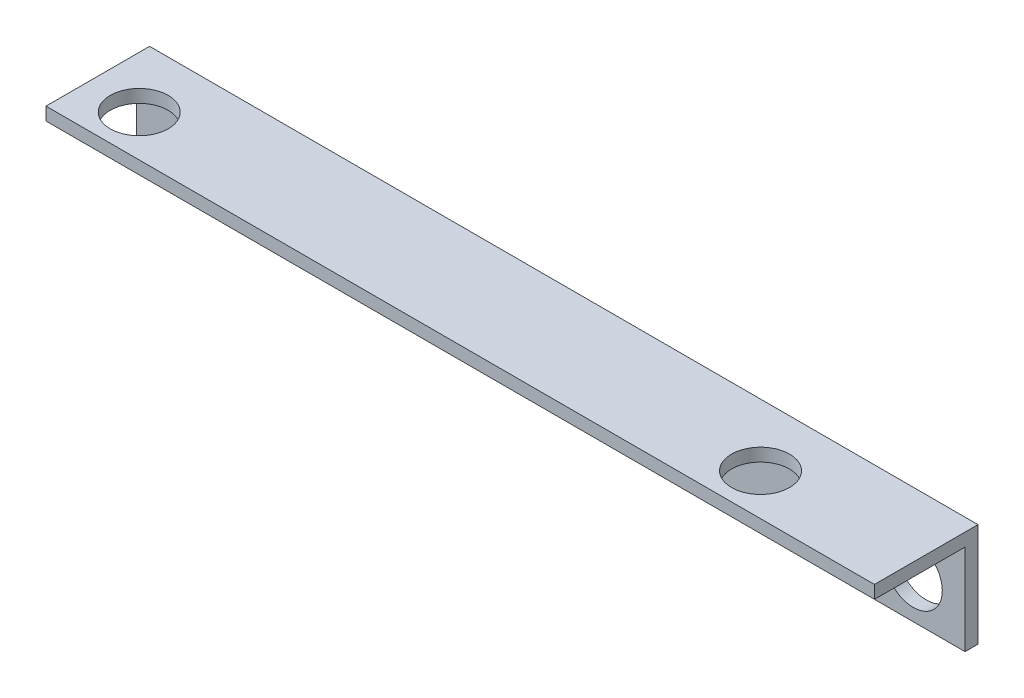
ISO-10303-21;
HEADER;
FILE_DESCRIPTION(('STEP AP214'),'2;1');
FILE_NAME('part.step','',(''),(''),'','','');
FILE_SCHEMA(('AUTOMOTIVE_DESIGN { 1 0 10303 214 1 1 1 1 }'));
ENDSEC;
DATA;
#1=APPLICATION_CONTEXT('core data for automotive mechanical design processes');
#2=APPLICATION_PROTOCOL_DEFINITION('international standard','automotive_design',2000,#1);
#3=PRODUCT_CONTEXT('',#1,'mechanical');
#4=PRODUCT('Part','Part','',(#3));
#5=PRODUCT_RELATED_PRODUCT_CATEGORY('part','',(#4));
#6=PRODUCT_DEFINITION_FORMATION('','',#4);
#7=PRODUCT_DEFINITION_CONTEXT('part definition',#1,'design');
#8=PRODUCT_DEFINITION('design','',#6,#7);
#9=PRODUCT_DEFINITION_SHAPE('','',#8);
#10=(LENGTH_UNIT() NAMED_UNIT(*) SI_UNIT(.MILLI.,.METRE.));
#11=(NAMED_UNIT(*) PLANE_ANGLE_UNIT() SI_UNIT($,.RADIAN.));
#12=(NAMED_UNIT(*) SI_UNIT($,.STERADIAN.) SOLID_ANGLE_UNIT());
#13=UNCERTAINTY_MEASURE_WITH_UNIT(LENGTH_MEASURE(1.E-05),#10,'distance_accuracy_value','');
#14=(GEOMETRIC_REPRESENTATION_CONTEXT(3) GLOBAL_UNCERTAINTY_ASSIGNED_CONTEXT((#13)) GLOBAL_UNIT_ASSIGNED_CONTEXT((#10,
#11,#12)) REPRESENTATION_CONTEXT('',''));
#15=CARTESIAN_POINT('',(0.,0.,0.));
#16=DIRECTION('',(0.,0.,1.));
#17=DIRECTION('',(1.,0.,0.));
#18=AXIS2_PLACEMENT_3D('',#15,#16,#17);
#19=CARTESIAN_POINT('',(-44.45,0.,1.5875));
#20=DIRECTION('',(0.,-1.,0.));
#21=DIRECTION('',(0.,0.,-1.));
#22=AXIS2_PLACEMENT_3D('',#19,#20,#21);
#23=PLANE('',#22);
#24=DIRECTION('',(1.,0.,0.));
#25=VECTOR('',#24,1.);
#26=CARTESIAN_POINT('',(-44.45,0.,0.));
#27=LINE('',#26,#25);
#28=CARTESIAN_POINT('',(-44.45,0.,0.));
#29=VERTEX_POINT('',#28);
#30=CARTESIAN_POINT('',(57.15,0.,0.));
#31=VERTEX_POINT('',#30);
#32=EDGE_CURVE('E45',#29,#31,#27,.T.);
#33=ORIENTED_EDGE('',*,*,#32,.T.);
#34=DIRECTION('',(0.,0.,-1.));
#35=VECTOR('',#34,1.);
#36=CARTESIAN_POINT('',(57.15,0.,1.5875));
#37=LINE('',#36,#35);
#38=CARTESIAN_POINT('',(57.15,0.,1.5875));
#39=VERTEX_POINT('',#38);
#40=EDGE_CURVE('E95',#39,#31,#37,.T.);
#41=ORIENTED_EDGE('',*,*,#40,.F.);
#42=DIRECTION('',(1.,0.,0.));
#43=VECTOR('',#42,1.);
#44=CARTESIAN_POINT('',(-44.45,0.,1.5875));
#45=LINE('',#44,#43);
#46=CARTESIAN_POINT('',(-44.45,0.,1.5875));
#47=VERTEX_POINT('',#46);
#48=EDGE_CURVE('E11',#47,#39,#45,.T.);
#49=ORIENTED_EDGE('',*,*,#48,.F.);
#50=DIRECTION('',(0.,0.,-1.));
#51=VECTOR('',#50,1.);
#52=CARTESIAN_POINT('',(-44.45,0.,1.5875));
#53=LINE('',#52,#51);
#54=EDGE_CURVE('E96',#47,#29,#53,.T.);
#55=ORIENTED_EDGE('',*,*,#54,.T.);
#56=EDGE_LOOP('',(#33,#41,#49,#55));
#57=FACE_BOUND('',#56,.T.);
#58=ADVANCED_FACE('F42',(#57),#23,.T.);
#59=CARTESIAN_POINT('',(-44.45,0.,1.5875));
#60=DIRECTION('',(0.,0.,1.));
#61=DIRECTION('',(1.,0.,0.));
#62=AXIS2_PLACEMENT_3D('',#59,#60,#61);
#63=PLANE('',#62);
#64=CARTESIAN_POINT('',(-25.4,5.08000000000001,1.5875));
#65=DIRECTION('',(0.,0.,1.));
#66=DIRECTION('',(1.,0.,0.));
#67=AXIS2_PLACEMENT_3D('',#64,#65,#66);
#68=CIRCLE('',#67,3.556);
#69=CARTESIAN_POINT('',(-21.844,5.08000000000001,1.5875));
#70=VERTEX_POINT('',#69);
#71=EDGE_CURVE('E117',#70,#70,#68,.T.);
#72=ORIENTED_EDGE('',*,*,#71,.F.);
#73=EDGE_LOOP('',(#72));
#74=FACE_BOUND('',#73,.T.);
#75=CARTESIAN_POINT('',(50.8,5.08,1.5875));
#76=DIRECTION('',(0.,0.,1.));
#77=DIRECTION('',(1.,0.,0.));
#78=AXIS2_PLACEMENT_3D('',#75,#76,#77);
#79=CIRCLE('',#78,3.556);
#80=CARTESIAN_POINT('',(54.356,5.08,1.5875));
#81=VERTEX_POINT('',#80);
#82=EDGE_CURVE('E121',#81,#81,#79,.T.);
#83=ORIENTED_EDGE('',*,*,#82,.F.);
#84=EDGE_LOOP('',(#83));
#85=FACE_BOUND('',#84,.T.);
#86=ORIENTED_EDGE('',*,*,#48,.T.);
#87=DIRECTION('',(0.,-1.,0.));
#88=VECTOR('',#87,1.);
#89=CARTESIAN_POINT('',(57.15,0.,1.5875));
#90=LINE('',#89,#88);
#91=CARTESIAN_POINT('',(57.15,11.1125,1.5875));
#92=VERTEX_POINT('',#91);
#93=EDGE_CURVE('E115',#92,#39,#90,.T.);
#94=ORIENTED_EDGE('',*,*,#93,.F.);
#95=DIRECTION('',(1.,0.,0.));
#96=VECTOR('',#95,1.);
#97=CARTESIAN_POINT('',(-44.45,11.1125,1.5875));
#98=LINE('',#97,#96);
#99=CARTESIAN_POINT('',(-44.45,11.1125,1.5875));
#100=VERTEX_POINT('',#99);
#101=EDGE_CURVE('E51',#100,#92,#98,.T.);
#102=ORIENTED_EDGE('',*,*,#101,.F.);
#103=DIRECTION('',(0.,-1.,0.));
#104=VECTOR('',#103,1.);
#105=CARTESIAN_POINT('',(-44.45,0.,1.5875));
#106=LINE('',#105,#104);
#107=EDGE_CURVE('E102',#100,#47,#106,.T.);
#108=ORIENTED_EDGE('',*,*,#107,.T.);
#109=EDGE_LOOP('',(#86,#94,#102,#108));
#110=FACE_BOUND('',#109,.T.);
#111=ADVANCED_FACE('F176',(#74,#85,#110),#63,.T.);
#112=CARTESIAN_POINT('',(-44.45,11.1125,1.5875));
#113=DIRECTION('',(0.,-1.,0.));
#114=DIRECTION('',(0.,0.,-1.));
#115=AXIS2_PLACEMENT_3D('',#112,#113,#114);
#116=PLANE('',#115);
#117=CARTESIAN_POINT('',(-38.1,11.1125,7.62));
#118=DIRECTION('',(0.,-1.,0.));
#119=DIRECTION('',(0.,0.,-1.));
#120=AXIS2_PLACEMENT_3D('',#117,#118,#119);
#121=CIRCLE('',#120,3.55600000000001);
#122=CARTESIAN_POINT('',(-38.1,11.1125,4.06399999999999));
#123=VERTEX_POINT('',#122);
#124=EDGE_CURVE('E211',#123,#123,#121,.T.);
#125=ORIENTED_EDGE('',*,*,#124,.F.);
#126=EDGE_LOOP('',(#125));
#127=FACE_BOUND('',#126,.T.);
#128=CARTESIAN_POINT('',(38.1,11.1125,7.62));
#129=DIRECTION('',(0.,-1.,0.));
#130=DIRECTION('',(0.,0.,-1.));
#131=AXIS2_PLACEMENT_3D('',#128,#129,#130);
#132=CIRCLE('',#131,3.55600000000001);
#133=CARTESIAN_POINT('',(38.1,11.1125,4.06399999999999));
#134=VERTEX_POINT('',#133);
#135=EDGE_CURVE('E217',#134,#134,#132,.T.);
#136=ORIENTED_EDGE('',*,*,#135,.F.);
#137=EDGE_LOOP('',(#136));
#138=FACE_BOUND('',#137,.T.);
#139=ORIENTED_EDGE('',*,*,#101,.T.);
#140=DIRECTION('',(0.,0.,-1.));
#141=VECTOR('',#140,1.);
#142=CARTESIAN_POINT('',(57.15,11.1125,1.5875));
#143=LINE('',#142,#141);
#144=CARTESIAN_POINT('',(57.15,11.1125,12.7));
#145=VERTEX_POINT('',#144);
#146=EDGE_CURVE('E131',#145,#92,#143,.T.);
#147=ORIENTED_EDGE('',*,*,#146,.F.);
#148=DIRECTION('',(1.,0.,0.));
#149=VECTOR('',#148,1.);
#150=CARTESIAN_POINT('',(-44.45,11.1125,12.7));
#151=LINE('',#150,#149);
#152=CARTESIAN_POINT('',(-44.45,11.1125,12.7));
#153=VERTEX_POINT('',#152);
#154=EDGE_CURVE('E156',#153,#145,#151,.T.);
#155=ORIENTED_EDGE('',*,*,#154,.F.);
#156=DIRECTION('',(0.,0.,-1.));
#157=VECTOR('',#156,1.);
#158=CARTESIAN_POINT('',(-44.45,11.1125,1.5875));
#159=LINE('',#158,#157);
#160=EDGE_CURVE('E149',#153,#100,#159,.T.);
#161=ORIENTED_EDGE('',*,*,#160,.T.);
#162=EDGE_LOOP('',(#139,#147,#155,#161));
#163=FACE_BOUND('',#162,.T.);
#164=ADVANCED_FACE('F172',(#127,#138,#163),#116,.T.);
#165=CARTESIAN_POINT('',(-44.45,11.1125,12.7));
#166=DIRECTION('',(0.,0.,1.));
#167=DIRECTION('',(1.,0.,0.));
#168=AXIS2_PLACEMENT_3D('',#165,#166,#167);
#169=PLANE('',#168);
#170=ORIENTED_EDGE('',*,*,#154,.T.);
#171=DIRECTION('',(0.,-1.,0.));
#172=VECTOR('',#171,1.);
#173=CARTESIAN_POINT('',(57.15,11.1125,12.7));
#174=LINE('',#173,#172);
#175=CARTESIAN_POINT('',(57.15,12.7,12.7));
#176=VERTEX_POINT('',#175);
#177=EDGE_CURVE('E127',#176,#145,#174,.T.);
#178=ORIENTED_EDGE('',*,*,#177,.F.);
#179=DIRECTION('',(1.,0.,0.));
#180=VECTOR('',#179,1.);
#181=CARTESIAN_POINT('',(-44.45,12.7,12.7));
#182=LINE('',#181,#180);
#183=CARTESIAN_POINT('',(-44.45,12.7,12.7));
#184=VERTEX_POINT('',#183);
#185=EDGE_CURVE('E159',#184,#176,#182,.T.);
#186=ORIENTED_EDGE('',*,*,#185,.F.);
#187=DIRECTION('',(0.,-1.,0.));
#188=VECTOR('',#187,1.);
#189=CARTESIAN_POINT('',(-44.45,11.1125,12.7));
#190=LINE('',#189,#188);
#191=EDGE_CURVE('E145',#184,#153,#190,.T.);
#192=ORIENTED_EDGE('',*,*,#191,.T.);
#193=EDGE_LOOP('',(#170,#178,#186,#192));
#194=FACE_BOUND('',#193,.T.);
#195=ADVANCED_FACE('F169',(#194),#169,.T.);
#196=CARTESIAN_POINT('',(-44.45,12.7,0.));
#197=DIRECTION('',(0.,1.,0.));
#198=DIRECTION('',(0.,0.,1.));
#199=AXIS2_PLACEMENT_3D('',#196,#197,#198);
#200=PLANE('',#199);
#201=CARTESIAN_POINT('',(-38.1,12.7,7.62));
#202=DIRECTION('',(0.,1.,0.));
#203=DIRECTION('',(0.,0.,1.));
#204=AXIS2_PLACEMENT_3D('',#201,#202,#203);
#205=CIRCLE('',#204,3.55600000000001);
#206=CARTESIAN_POINT('',(-38.1,12.7,11.176));
#207=VERTEX_POINT('',#206);
#208=EDGE_CURVE('E247',#207,#207,#205,.T.);
#209=ORIENTED_EDGE('',*,*,#208,.F.);
#210=EDGE_LOOP('',(#209));
#211=FACE_BOUND('',#210,.T.);
#212=CARTESIAN_POINT('',(38.1,12.7,7.62));
#213=DIRECTION('',(0.,1.,0.));
#214=DIRECTION('',(0.,0.,1.));
#215=AXIS2_PLACEMENT_3D('',#212,#213,#214);
#216=CIRCLE('',#215,3.55600000000001);
#217=CARTESIAN_POINT('',(38.1,12.7,11.176));
#218=VERTEX_POINT('',#217);
#219=EDGE_CURVE('E249',#218,#218,#216,.T.);
#220=ORIENTED_EDGE('',*,*,#219,.F.);
#221=EDGE_LOOP('',(#220));
#222=FACE_BOUND('',#221,.T.);
#223=ORIENTED_EDGE('',*,*,#185,.T.);
#224=DIRECTION('',(0.,0.,1.));
#225=VECTOR('',#224,1.);
#226=CARTESIAN_POINT('',(57.15,12.7,0.));
#227=LINE('',#226,#225);
#228=CARTESIAN_POINT('',(57.15,12.7,0.));
#229=VERTEX_POINT('',#228);
#230=EDGE_CURVE('E110',#229,#176,#227,.T.);
#231=ORIENTED_EDGE('',*,*,#230,.F.);
#232=DIRECTION('',(1.,0.,0.));
#233=VECTOR('',#232,1.);
#234=CARTESIAN_POINT('',(-44.45,12.7,0.));
#235=LINE('',#234,#233);
#236=CARTESIAN_POINT('',(-44.45,12.7,0.));
#237=VERTEX_POINT('',#236);
#238=EDGE_CURVE('E101',#237,#229,#235,.T.);
#239=ORIENTED_EDGE('',*,*,#238,.F.);
#240=DIRECTION('',(0.,0.,1.));
#241=VECTOR('',#240,1.);
#242=CARTESIAN_POINT('',(-44.45,12.7,0.));
#243=LINE('',#242,#241);
#244=EDGE_CURVE('E141',#237,#184,#243,.T.);
#245=ORIENTED_EDGE('',*,*,#244,.T.);
#246=EDGE_LOOP('',(#223,#231,#239,#245));
#247=FACE_BOUND('',#246,.T.);
#248=ADVANCED_FACE('F163',(#211,#222,#247),#200,.T.);
#249=CARTESIAN_POINT('',(-44.45,0.,0.));
#250=DIRECTION('',(0.,0.,-1.));
#251=DIRECTION('',(-1.,0.,0.));
#252=AXIS2_PLACEMENT_3D('',#249,#250,#251);
#253=PLANE('',#252);
#254=CARTESIAN_POINT('',(-25.4,5.08000000000001,0.));
#255=DIRECTION('',(0.,0.,-1.));
#256=DIRECTION('',(-1.,0.,0.));
#257=AXIS2_PLACEMENT_3D('',#254,#255,#256);
#258=CIRCLE('',#257,3.556);
#259=CARTESIAN_POINT('',(-28.956,5.08000000000001,0.));
#260=VERTEX_POINT('',#259);
#261=EDGE_CURVE('E205',#260,#260,#258,.T.);
#262=ORIENTED_EDGE('',*,*,#261,.F.);
#263=EDGE_LOOP('',(#262));
#264=FACE_BOUND('',#263,.T.);
#265=CARTESIAN_POINT('',(50.8,5.08,0.));
#266=DIRECTION('',(0.,0.,-1.));
#267=DIRECTION('',(-1.,0.,0.));
#268=AXIS2_PLACEMENT_3D('',#265,#266,#267);
#269=CIRCLE('',#268,3.556);
#270=CARTESIAN_POINT('',(47.244,5.08,0.));
#271=VERTEX_POINT('',#270);
#272=EDGE_CURVE('E208',#271,#271,#269,.T.);
#273=ORIENTED_EDGE('',*,*,#272,.F.);
#274=EDGE_LOOP('',(#273));
#275=FACE_BOUND('',#274,.T.);
#276=ORIENTED_EDGE('',*,*,#238,.T.);
#277=DIRECTION('',(0.,1.,0.));
#278=VECTOR('',#277,1.);
#279=CARTESIAN_POINT('',(57.15,0.,0.));
#280=LINE('',#279,#278);
#281=EDGE_CURVE('E104',#31,#229,#280,.T.);
#282=ORIENTED_EDGE('',*,*,#281,.F.);
#283=ORIENTED_EDGE('',*,*,#32,.F.);
#284=DIRECTION('',(0.,1.,0.));
#285=VECTOR('',#284,1.);
#286=CARTESIAN_POINT('',(-44.45,0.,0.));
#287=LINE('',#286,#285);
#288=EDGE_CURVE('E138',#29,#237,#287,.T.);
#289=ORIENTED_EDGE('',*,*,#288,.T.);
#290=EDGE_LOOP('',(#276,#282,#283,#289));
#291=FACE_BOUND('',#290,.T.);
#292=ADVANCED_FACE('F105',(#264,#275,#291),#253,.T.);
#293=CARTESIAN_POINT('',(-44.45,0.,0.));
#294=DIRECTION('',(1.,0.,0.));
#295=DIRECTION('',(0.,0.,-1.));
#296=AXIS2_PLACEMENT_3D('',#293,#294,#295);
#297=PLANE('',#296);
#298=ORIENTED_EDGE('',*,*,#54,.F.);
#299=ORIENTED_EDGE('',*,*,#107,.F.);
#300=ORIENTED_EDGE('',*,*,#160,.F.);
#301=ORIENTED_EDGE('',*,*,#191,.F.);
#302=ORIENTED_EDGE('',*,*,#244,.F.);
#303=ORIENTED_EDGE('',*,*,#288,.F.);
#304=EDGE_LOOP('',(#298,#299,#300,#301,#302,#303));
#305=FACE_BOUND('',#304,.T.);
#306=ADVANCED_FACE('F175',(#305),#297,.F.);
#307=CARTESIAN_POINT('',(57.15,0.,0.));
#308=DIRECTION('',(1.,0.,0.));
#309=DIRECTION('',(0.,0.,-1.));
#310=AXIS2_PLACEMENT_3D('',#307,#308,#309);
#311=PLANE('',#310);
#312=ORIENTED_EDGE('',*,*,#40,.T.);
#313=ORIENTED_EDGE('',*,*,#281,.T.);
#314=ORIENTED_EDGE('',*,*,#230,.T.);
#315=ORIENTED_EDGE('',*,*,#177,.T.);
#316=ORIENTED_EDGE('',*,*,#146,.T.);
#317=ORIENTED_EDGE('',*,*,#93,.T.);
#318=EDGE_LOOP('',(#312,#313,#314,#315,#316,#317));
#319=FACE_BOUND('',#318,.T.);
#320=ADVANCED_FACE('F113',(#319),#311,.T.);
#321=CARTESIAN_POINT('',(50.8,5.08,12.7));
#322=DIRECTION('',(0.,0.,-1.));
#323=DIRECTION('',(-1.,0.,0.));
#324=AXIS2_PLACEMENT_3D('',#321,#322,#323);
#325=CYLINDRICAL_SURFACE('',#324,3.556);
#326=ORIENTED_EDGE('',*,*,#82,.T.);
#327=EDGE_LOOP('',(#326));
#328=FACE_BOUND('',#327,.T.);
#329=ORIENTED_EDGE('',*,*,#272,.T.);
#330=EDGE_LOOP('',(#329));
#331=FACE_BOUND('',#330,.T.);
#332=ADVANCED_FACE('F223',(#328,#331),#325,.F.);
#333=CARTESIAN_POINT('',(-25.4,5.08000000000001,12.7));
#334=DIRECTION('',(0.,0.,-1.));
#335=DIRECTION('',(-1.,0.,0.));
#336=AXIS2_PLACEMENT_3D('',#333,#334,#335);
#337=CYLINDRICAL_SURFACE('',#336,3.556);
#338=ORIENTED_EDGE('',*,*,#71,.T.);
#339=EDGE_LOOP('',(#338));
#340=FACE_BOUND('',#339,.T.);
#341=ORIENTED_EDGE('',*,*,#261,.T.);
#342=EDGE_LOOP('',(#341));
#343=FACE_BOUND('',#342,.T.);
#344=ADVANCED_FACE('F225',(#340,#343),#337,.F.);
#345=CARTESIAN_POINT('',(38.1,0.,7.62));
#346=DIRECTION('',(0.,1.,0.));
#347=DIRECTION('',(0.,0.,1.));
#348=AXIS2_PLACEMENT_3D('',#345,#346,#347);
#349=CYLINDRICAL_SURFACE('',#348,3.55600000000001);
#350=ORIENTED_EDGE('',*,*,#135,.T.);
#351=EDGE_LOOP('',(#350));
#352=FACE_BOUND('',#351,.T.);
#353=ORIENTED_EDGE('',*,*,#219,.T.);
#354=EDGE_LOOP('',(#353));
#355=FACE_BOUND('',#354,.T.);
#356=ADVANCED_FACE('F231',(#352,#355),#349,.F.);
#357=CARTESIAN_POINT('',(-38.1,0.,7.62));
#358=DIRECTION('',(0.,1.,0.));
#359=DIRECTION('',(0.,0.,1.));
#360=AXIS2_PLACEMENT_3D('',#357,#358,#359);
#361=CYLINDRICAL_SURFACE('',#360,3.55600000000001);
#362=ORIENTED_EDGE('',*,*,#124,.T.);
#363=EDGE_LOOP('',(#362));
#364=FACE_BOUND('',#363,.T.);
#365=ORIENTED_EDGE('',*,*,#208,.T.);
#366=EDGE_LOOP('',(#365));
#367=FACE_BOUND('',#366,.T.);
#368=ADVANCED_FACE('F237',(#364,#367),#361,.F.);
#369=CLOSED_SHELL('',(#58,#111,#164,#195,#248,#292,#306,#320,#332,#344,#356,#368));
#370=MANIFOLD_SOLID_BREP('B2',#369);
#371=ADVANCED_BREP_SHAPE_REPRESENTATION('',(#18,#370),#14);
#372=SHAPE_DEFINITION_REPRESENTATION(#9,#371);
ENDSEC;
END-ISO-10303-21;
